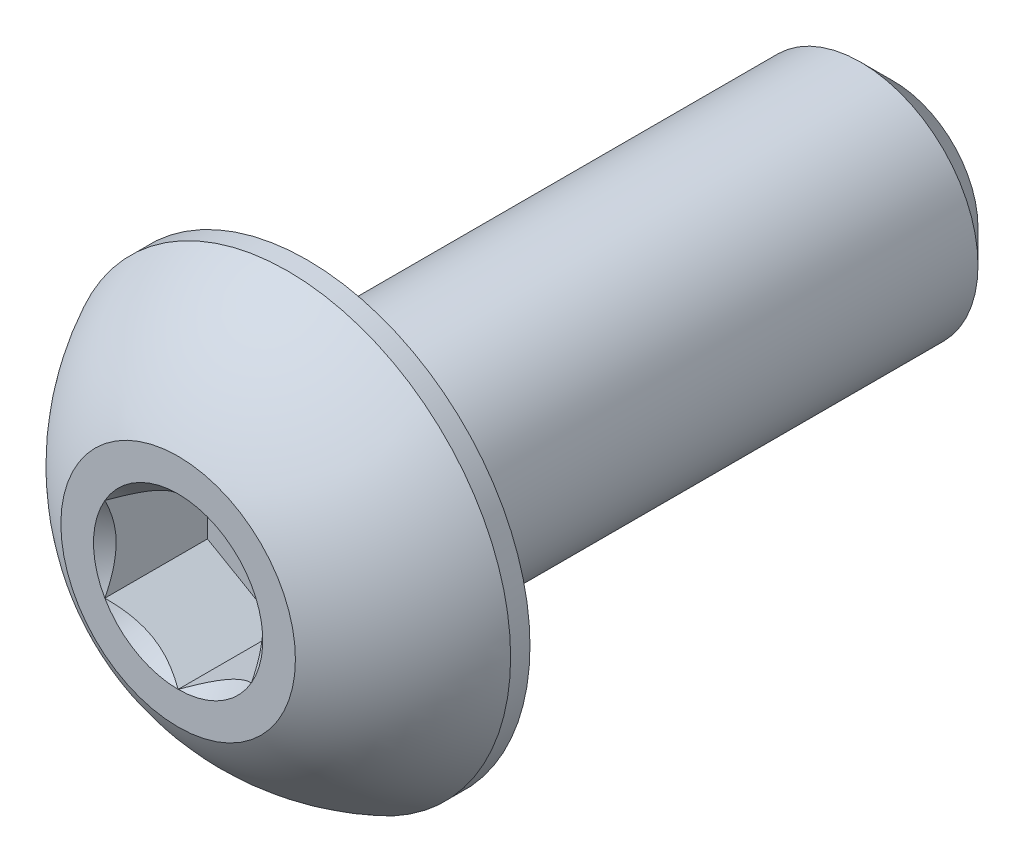
ISO-10303-21;
HEADER;
FILE_DESCRIPTION(('STEP AP214'),'2;1');
FILE_NAME('part.step','',(''),(''),'','','');
FILE_SCHEMA(('AUTOMOTIVE_DESIGN { 1 0 10303 214 1 1 1 1 }'));
ENDSEC;
DATA;
#1=APPLICATION_CONTEXT('core data for automotive mechanical design processes');
#2=APPLICATION_PROTOCOL_DEFINITION('international standard','automotive_design',2000,#1);
#3=PRODUCT_CONTEXT('',#1,'mechanical');
#4=PRODUCT('Part','Part','',(#3));
#5=PRODUCT_RELATED_PRODUCT_CATEGORY('part','',(#4));
#6=PRODUCT_DEFINITION_FORMATION('','',#4);
#7=PRODUCT_DEFINITION_CONTEXT('part definition',#1,'design');
#8=PRODUCT_DEFINITION('design','',#6,#7);
#9=PRODUCT_DEFINITION_SHAPE('','',#8);
#10=(LENGTH_UNIT() NAMED_UNIT(*) SI_UNIT(.MILLI.,.METRE.));
#11=(NAMED_UNIT(*) PLANE_ANGLE_UNIT() SI_UNIT($,.RADIAN.));
#12=(NAMED_UNIT(*) SI_UNIT($,.STERADIAN.) SOLID_ANGLE_UNIT());
#13=UNCERTAINTY_MEASURE_WITH_UNIT(LENGTH_MEASURE(1.E-05),#10,'distance_accuracy_value','');
#14=(GEOMETRIC_REPRESENTATION_CONTEXT(3) GLOBAL_UNCERTAINTY_ASSIGNED_CONTEXT((#13)) GLOBAL_UNIT_ASSIGNED_CONTEXT((#10,
#11,#12)) REPRESENTATION_CONTEXT('',''));
#15=CARTESIAN_POINT('',(0.,0.,0.));
#16=DIRECTION('',(0.,0.,1.));
#17=DIRECTION('',(1.,0.,0.));
#18=AXIS2_PLACEMENT_3D('',#15,#16,#17);
#19=CARTESIAN_POINT('',(0.,0.,6.1));
#20=DIRECTION('',(0.,0.,-1.));
#21=DIRECTION('',(-1.,0.,0.));
#22=AXIS2_PLACEMENT_3D('',#19,#20,#21);
#23=PLANE('',#22);
#24=CARTESIAN_POINT('',(0.,0.,6.1));
#25=DIRECTION('',(0.,0.,1.));
#26=DIRECTION('',(1.,0.,0.));
#27=AXIS2_PLACEMENT_3D('',#24,#25,#26);
#28=CIRCLE('',#27,1.44337567297406);
#29=CARTESIAN_POINT('',(-1.25,0.721687836487033,6.1));
#30=VERTEX_POINT('',#29);
#31=CARTESIAN_POINT('',(-1.25,-0.721687836487033,6.1));
#32=VERTEX_POINT('',#31);
#33=EDGE_CURVE('E132',#30,#32,#28,.T.);
#34=ORIENTED_EDGE('',*,*,#33,.F.);
#35=CARTESIAN_POINT('',(0.,1.44337567297406,6.1));
#36=VERTEX_POINT('',#35);
#37=EDGE_CURVE('E104',#36,#30,#28,.T.);
#38=ORIENTED_EDGE('',*,*,#37,.F.);
#39=CARTESIAN_POINT('',(1.25,0.721687836487032,6.1));
#40=VERTEX_POINT('',#39);
#41=EDGE_CURVE('E95',#40,#36,#28,.T.);
#42=ORIENTED_EDGE('',*,*,#41,.F.);
#43=CARTESIAN_POINT('',(1.25,-0.721687836487032,6.1));
#44=VERTEX_POINT('',#43);
#45=EDGE_CURVE('E56',#44,#40,#28,.T.);
#46=ORIENTED_EDGE('',*,*,#45,.F.);
#47=CARTESIAN_POINT('',(0.,-1.44337567297406,6.1));
#48=VERTEX_POINT('',#47);
#49=EDGE_CURVE('E63',#48,#44,#28,.T.);
#50=ORIENTED_EDGE('',*,*,#49,.F.);
#51=EDGE_CURVE('E133',#32,#48,#28,.T.);
#52=ORIENTED_EDGE('',*,*,#51,.F.);
#53=EDGE_LOOP('',(#34,#38,#42,#46,#50,#52));
#54=FACE_BOUND('',#53,.T.);
#55=CARTESIAN_POINT('',(0.,0.,6.1));
#56=DIRECTION('',(0.,0.,1.));
#57=DIRECTION('',(1.,0.,0.));
#58=AXIS2_PLACEMENT_3D('',#55,#56,#57);
#59=CIRCLE('',#58,2.);
#60=CARTESIAN_POINT('',(0.,2.,6.1));
#61=VERTEX_POINT('',#60);
#62=EDGE_CURVE('E50',#61,#61,#59,.T.);
#63=ORIENTED_EDGE('',*,*,#62,.T.);
#64=EDGE_LOOP('',(#63));
#65=FACE_BOUND('',#64,.T.);
#66=ADVANCED_FACE('F37',(#54,#65),#23,.F.);
#67=CARTESIAN_POINT('',(0.,0.,2.37355614973262));
#68=DIRECTION('',(0.,0.,1.));
#69=DIRECTION('',(0.,1.,0.));
#70=AXIS2_PLACEMENT_3D('',#67,#68,#69);
#71=SPHERICAL_SURFACE('',#70,4.22922968981298);
#72=CARTESIAN_POINT('',(0.,0.,4.23));
#73=DIRECTION('',(0.,0.,1.));
#74=DIRECTION('',(1.,0.,0.));
#75=AXIS2_PLACEMENT_3D('',#72,#73,#74);
#76=CIRCLE('',#75,3.8);
#77=CARTESIAN_POINT('',(0.,3.8,4.23));
#78=VERTEX_POINT('',#77);
#79=EDGE_CURVE('E215',#78,#78,#76,.T.);
#80=CARTESIAN_POINT('',(0.,2.,6.1));
#81=CARTESIAN_POINT('',(0.,2.02421343985614,6.08700457403551));
#82=CARTESIAN_POINT('',(0.,2.04830018323974,6.07377308703487));
#83=CARTESIAN_POINT('',(0.,2.09621120342126,6.04684315849425));
#84=CARTESIAN_POINT('',(0.,2.12003548021917,6.03314471695428));
#85=CARTESIAN_POINT('',(0.,2.16741249358867,6.00528604686797));
#86=CARTESIAN_POINT('',(0.,2.19096523016026,5.99112581832164));
#87=CARTESIAN_POINT('',(0.,2.23779021933682,5.96234896476405));
#88=CARTESIAN_POINT('',(0.,2.2610624719418,5.94773233975278));
#89=CARTESIAN_POINT('',(0.,2.30731764886072,5.91804824448586));
#90=CARTESIAN_POINT('',(0.,2.33030057317465,5.90298077423021));
#91=CARTESIAN_POINT('',(0.,2.37596836104235,5.87240071441713));
#92=CARTESIAN_POINT('',(0.,2.39865322459612,5.85688812485971));
#93=CARTESIAN_POINT('',(0.,2.44371627121513,5.82542372060412));
#94=CARTESIAN_POINT('',(0.,2.46609445428038,5.80947190590595));
#95=CARTESIAN_POINT('',(0.,2.51053563686181,5.77713511266833));
#96=CARTESIAN_POINT('',(0.,2.532598636378,5.76075013412888));
#97=CARTESIAN_POINT('',(0.,2.57640106852492,5.72755323903277));
#98=CARTESIAN_POINT('',(0.,2.59814050115564,5.71074132247611));
#99=CARTESIAN_POINT('',(0.,2.64128753915153,5.67669693941185));
#100=CARTESIAN_POINT('',(0.,2.66269514451671,5.65946447290426));
#101=CARTESIAN_POINT('',(0.,2.70517039368395,5.62458553779704));
#102=CARTESIAN_POINT('',(0.,2.72623803748602,5.6069390691974));
#103=CARTESIAN_POINT('',(0.,2.76802535840618,5.57123883507559));
#104=CARTESIAN_POINT('',(0.,2.78874503552428,5.55318506955341));
#105=CARTESIAN_POINT('',(0.,2.82982855017313,5.51667710151719));
#106=CARTESIAN_POINT('',(0.,2.85019238770389,5.49822289900316));
#107=CARTESIAN_POINT('',(0.,2.89055648548394,5.46092106906898));
#108=CARTESIAN_POINT('',(0.,2.91055674573324,5.44207344164884));
#109=CARTESIAN_POINT('',(0.,2.95018608940553,5.40399192347874));
#110=CARTESIAN_POINT('',(0.,2.96981517282852,5.38475803272878));
#111=CARTESIAN_POINT('',(0.,3.00869470434027,5.34591129624471));
#112=CARTESIAN_POINT('',(0.,3.02794515242903,5.3262984505106));
#113=CARTESIAN_POINT('',(0.,3.06606009863533,5.28670125639628));
#114=CARTESIAN_POINT('',(0.,3.08492459675287,5.26671690801607));
#115=CARTESIAN_POINT('',(0.,3.12226047503002,5.22638430210832));
#116=CARTESIAN_POINT('',(0.,3.14073185518965,5.20603604458079));
#117=CARTESIAN_POINT('',(0.,3.17727447893821,5.16498335215256));
#118=CARTESIAN_POINT('',(0.,3.19534572252715,5.14427891725186));
#119=CARTESIAN_POINT('',(0.,3.23108120656242,5.10252173718901));
#120=CARTESIAN_POINT('',(0.,3.24874544700875,5.08146899202686));
#121=CARTESIAN_POINT('',(0.,3.28366021283673,5.03902319090103));
#122=CARTESIAN_POINT('',(0.,3.30091073821838,5.01763013493736));
#123=CARTESIAN_POINT('',(0.,3.33499151919534,4.97451184097717));
#124=CARTESIAN_POINT('',(0.,3.35182177479064,4.95278660298064));
#125=CARTESIAN_POINT('',(0.,3.38505562116371,4.9090121999432));
#126=CARTESIAN_POINT('',(0.,3.40145921194149,4.88696303490229));
#127=CARTESIAN_POINT('',(0.,3.43383349577047,4.84254915584848));
#128=CARTESIAN_POINT('',(0.,3.44980418882166,4.8201844418356));
#129=CARTESIAN_POINT('',(0.,3.48130660877275,4.77514796280767));
#130=CARTESIAN_POINT('',(0.,3.49683833567264,4.75247619779264));
#131=CARTESIAN_POINT('',(0.,3.52745692170931,4.70683423141033));
#132=CARTESIAN_POINT('',(0.,3.5425437808461,4.68386403004306));
#133=CARTESIAN_POINT('',(0.,3.57226689871518,4.63763391896935));
#134=CARTESIAN_POINT('',(0.,3.58690315744748,4.61437400926291));
#135=CARTESIAN_POINT('',(0.,3.61571951333199,4.56757331973341));
#136=CARTESIAN_POINT('',(0.,3.62989961048422,4.54403253991033));
#137=CARTESIAN_POINT('',(0.,3.65779825442823,4.4966790546141));
#138=CARTESIAN_POINT('',(0.,3.67151680122002,4.47286634914094));
#139=CARTESIAN_POINT('',(0.,3.69848713452321,4.42497806212234));
#140=CARTESIAN_POINT('',(0.,3.71173892103461,4.4009024805769));
#141=CARTESIAN_POINT('',(0.,3.73777068821038,4.35249758420785));
#142=CARTESIAN_POINT('',(0.,3.75055066887474,4.32816826938425));
#143=CARTESIAN_POINT('',(0.,3.77563400658953,4.27926517055481));
#144=CARTESIAN_POINT('',(0.,3.78793736363997,4.25469138654898));
#145=CARTESIAN_POINT('',(0.,3.8,4.23));
#146=B_SPLINE_CURVE_WITH_KNOTS('',3,(#80,#81,#82,#83,#84,#85,#86,#87,#88,#89,#90,#91,#92,#93,
#94,#95,#96,#97,#98,#99,#100,#101,#102,#103,#104,#105,#106,#107,#108,#109,#110,#111,#112,#113,
#114,#115,#116,#117,#118,#119,#120,#121,#122,#123,#124,#125,#126,#127,#128,#129,#130,#131,#132,
#133,#134,#135,#136,#137,#138,#139,#140,#141,#142,#143,#144,#145),.UNSPECIFIED.,.F.,.F.,(4,2,2,
2,2,2,2,2,2,2,2,2,2,2,2,2,2,2,2,2,2,2,2,2,2,2,2,2,2,2,2,2,4),(0.,0.0824398589102646,
0.164879717820529,0.247319576730793,0.329759435641058,0.412199294551322,0.494639153461587,
0.57707901237185,0.659518871282115,0.741958730192379,0.824398589102644,0.906838448012908,
0.989278306923172,1.07171816583344,1.1541580247437,1.23659788365396,1.31903774256423,
1.40147760147449,1.48391746038476,1.56635731929502,1.64879717820529,1.73123703711555,
1.81367689602582,1.89611675493608,1.97855661384634,2.06099647275661,2.14343633166687,
2.22587619057714,2.3083160494874,2.39075590839767,2.47319576730793,2.55563562621819,
2.63807548512846),.UNSPECIFIED.);
#147=EDGE_CURVE('BSEAM220',#61,#78,#146,.T.);
#148=ORIENTED_EDGE('',*,*,#62,.F.);
#149=ORIENTED_EDGE('',*,*,#79,.T.);
#150=ORIENTED_EDGE('',*,*,#147,.T.);
#151=ORIENTED_EDGE('',*,*,#147,.F.);
#152=EDGE_LOOP('',(#148,#150,#149,#151));
#153=FACE_BOUND('',#152,.T.);
#154=ADVANCED_FACE('F220',(#153),#71,.T.);
#155=CARTESIAN_POINT('',(0.,0.,6.1));
#156=DIRECTION('',(0.,0.,1.));
#157=DIRECTION('',(1.,0.,0.));
#158=AXIS2_PLACEMENT_3D('',#155,#156,#157);
#159=CYLINDRICAL_SURFACE('',#158,3.8);
#160=ORIENTED_EDGE('',*,*,#79,.F.);
#161=EDGE_LOOP('',(#160));
#162=FACE_BOUND('',#161,.T.);
#163=CARTESIAN_POINT('',(0.,0.,3.9));
#164=DIRECTION('',(0.,0.,1.));
#165=DIRECTION('',(1.,0.,0.));
#166=AXIS2_PLACEMENT_3D('',#163,#164,#165);
#167=CIRCLE('',#166,3.8);
#168=CARTESIAN_POINT('',(3.8,0.,3.9));
#169=VERTEX_POINT('',#168);
#170=EDGE_CURVE('E212',#169,#169,#167,.T.);
#171=ORIENTED_EDGE('',*,*,#170,.T.);
#172=EDGE_LOOP('',(#171));
#173=FACE_BOUND('',#172,.T.);
#174=ADVANCED_FACE('F223',(#162,#173),#159,.T.);
#175=CARTESIAN_POINT('',(0.,2.,3.9));
#176=DIRECTION('',(0.,0.,1.));
#177=DIRECTION('',(1.,0.,0.));
#178=AXIS2_PLACEMENT_3D('',#175,#176,#177);
#179=PLANE('',#178);
#180=ORIENTED_EDGE('',*,*,#170,.F.);
#181=EDGE_LOOP('',(#180));
#182=FACE_BOUND('',#181,.T.);
#183=CARTESIAN_POINT('',(0.,0.,3.9));
#184=DIRECTION('',(0.,0.,1.));
#185=DIRECTION('',(1.,0.,0.));
#186=AXIS2_PLACEMENT_3D('',#183,#184,#185);
#187=CIRCLE('',#186,2.);
#188=CARTESIAN_POINT('',(2.,0.,3.9));
#189=VERTEX_POINT('',#188);
#190=EDGE_CURVE('E209',#189,#189,#187,.T.);
#191=ORIENTED_EDGE('',*,*,#190,.T.);
#192=EDGE_LOOP('',(#191));
#193=FACE_BOUND('',#192,.T.);
#194=ADVANCED_FACE('F228',(#182,#193),#179,.F.);
#195=CARTESIAN_POINT('',(0.,0.,6.1));
#196=DIRECTION('',(0.,0.,1.));
#197=DIRECTION('',(1.,0.,0.));
#198=AXIS2_PLACEMENT_3D('',#195,#196,#197);
#199=CYLINDRICAL_SURFACE('',#198,2.);
#200=ORIENTED_EDGE('',*,*,#190,.F.);
#201=EDGE_LOOP('',(#200));
#202=FACE_BOUND('',#201,.T.);
#203=CARTESIAN_POINT('',(0.,0.,-5.54));
#204=DIRECTION('',(0.,0.,1.));
#205=DIRECTION('',(1.,0.,0.));
#206=AXIS2_PLACEMENT_3D('',#203,#204,#205);
#207=CIRCLE('',#206,2.);
#208=CARTESIAN_POINT('',(2.,0.,-5.54));
#209=VERTEX_POINT('',#208);
#210=EDGE_CURVE('E206',#209,#209,#207,.T.);
#211=ORIENTED_EDGE('',*,*,#210,.T.);
#212=EDGE_LOOP('',(#211));
#213=FACE_BOUND('',#212,.T.);
#214=ADVANCED_FACE('F234',(#202,#213),#199,.T.);
#215=CARTESIAN_POINT('',(0.,0.,-6.1));
#216=DIRECTION('',(0.,0.,1.));
#217=DIRECTION('',(1.,0.,0.));
#218=AXIS2_PLACEMENT_3D('',#215,#216,#217);
#219=CONICAL_SURFACE('',#218,1.44,0.785398163397445);
#220=ORIENTED_EDGE('',*,*,#210,.F.);
#221=EDGE_LOOP('',(#220));
#222=FACE_BOUND('',#221,.T.);
#223=CARTESIAN_POINT('',(0.,0.,-6.1));
#224=DIRECTION('',(0.,0.,1.));
#225=DIRECTION('',(1.,0.,0.));
#226=AXIS2_PLACEMENT_3D('',#223,#224,#225);
#227=CIRCLE('',#226,1.44);
#228=CARTESIAN_POINT('',(1.44,0.,-6.1));
#229=VERTEX_POINT('',#228);
#230=EDGE_CURVE('E193',#229,#229,#227,.T.);
#231=ORIENTED_EDGE('',*,*,#230,.T.);
#232=EDGE_LOOP('',(#231));
#233=FACE_BOUND('',#232,.T.);
#234=ADVANCED_FACE('F240',(#222,#233),#219,.T.);
#235=CARTESIAN_POINT('',(0.,0.,-6.1));
#236=DIRECTION('',(0.,0.,1.));
#237=DIRECTION('',(1.,0.,0.));
#238=AXIS2_PLACEMENT_3D('',#235,#236,#237);
#239=PLANE('',#238);
#240=ORIENTED_EDGE('',*,*,#230,.F.);
#241=EDGE_LOOP('',(#240));
#242=FACE_BOUND('',#241,.T.);
#243=ADVANCED_FACE('F166',(#242),#239,.F.);
#244=CARTESIAN_POINT('',(0.,0.,6.1));
#245=DIRECTION('',(0.,0.,1.));
#246=DIRECTION('',(1.,0.,0.));
#247=AXIS2_PLACEMENT_3D('',#244,#245,#246);
#248=CONICAL_SURFACE('',#247,1.44337567297406,0.78539816339745);
#249=ORIENTED_EDGE('',*,*,#37,.T.);
#250=CARTESIAN_POINT('',(0.000199999999999987,1.4434911430279,6.10011548390914));
#251=CARTESIAN_POINT('',(-0.0427751670715869,1.41867941875065,6.07532166805511));
#252=CARTESIAN_POINT('',(-0.0864690047459484,1.39345276980743,6.05198373441868));
#253=CARTESIAN_POINT('',(-0.175565930841942,1.34201263554194,6.00925200408454));
#254=CARTESIAN_POINT('',(-0.220977498357064,1.31579425481276,5.98988199236041));
#255=CARTESIAN_POINT('',(-0.31254782093526,1.26292610442246,5.95670048341348));
#256=CARTESIAN_POINT('',(-0.358683240175886,1.23628980770471,5.94280555905266));
#257=CARTESIAN_POINT('',(-0.451970080407593,1.18243062538508,5.92139728216064));
#258=CARTESIAN_POINT('',(-0.49911864913638,1.15520938653761,5.91386794156679));
#259=CARTESIAN_POINT('',(-0.580373556887253,1.10829684367467,5.9070744980507));
#260=CARTESIAN_POINT('',(-0.614374876627941,1.08866617256958,5.90606855910435));
#261=CARTESIAN_POINT('',(-0.682317764432478,1.04943932800611,5.90776141491132));
#262=CARTESIAN_POINT('',(-0.716259317655658,1.02984316311599,5.91046102721554));
#263=CARTESIAN_POINT('',(-0.7838148564575,0.990839954603499,5.91940893031638));
#264=CARTESIAN_POINT('',(-0.817428507286775,0.971433104248771,5.92566052589971));
#265=CARTESIAN_POINT('',(-0.884094638217813,0.932943395609905,5.94137568141391));
#266=CARTESIAN_POINT('',(-0.917146871030296,0.913860680098301,5.95084062008746));
#267=CARTESIAN_POINT('',(-1.00179969160026,0.864986351354568,5.97893139068759));
#268=CARTESIAN_POINT('',(-1.05286649242964,0.835502920149076,5.9996701574522));
#269=CARTESIAN_POINT('',(-1.15300085411325,0.777690319475909,6.04638713467148));
#270=CARTESIAN_POINT('',(-1.20207431157827,0.749357745598417,6.07234829594677));
#271=CARTESIAN_POINT('',(-1.2502,0.721572366433195,6.10011548390914));
#272=B_SPLINE_CURVE_WITH_KNOTS('',3,(#250,#251,#252,#253,#254,#255,#256,#257,#258,#259,#260,
#261,#262,#263,#264,#265,#266,#267,#268,#269,#270,#271),.UNSPECIFIED.,.F.,.F.,(4,2,2,2,2,2,2,2,
2,2,4),(0.,0.166533409618304,0.334037607289762,0.498880396489699,0.663307919240275,
0.780963963458827,0.898645970148453,1.01643764860773,1.1342799317155,1.32148652032141,
1.50809158792573),.UNSPECIFIED.);
#273=EDGE_CURVE('E11',#36,#30,#272,.T.);
#274=ORIENTED_EDGE('',*,*,#273,.F.);
#275=EDGE_LOOP('',(#249,#274));
#276=FACE_BOUND('',#275,.T.);
#277=ADVANCED_FACE('F108',(#276),#248,.F.);
#278=ORIENTED_EDGE('',*,*,#33,.T.);
#279=CARTESIAN_POINT('',(-1.25,-1.43934010808077,6.56298209689233));
#280=CARTESIAN_POINT('',(-1.25,-1.40429313005659,6.53652492263289));
#281=CARTESIAN_POINT('',(-1.25,-1.36905087135599,6.51032716035428));
#282=CARTESIAN_POINT('',(-1.25,-1.29809650706311,6.45855757183958));
#283=CARTESIAN_POINT('',(-1.25,-1.26238428576495,6.43298590435629));
#284=CARTESIAN_POINT('',(-1.25,-1.15390111792708,6.35700599368946));
#285=CARTESIAN_POINT('',(-1.25,-1.08031646726264,6.30774028618957));
#286=CARTESIAN_POINT('',(-1.25,-0.926012322755095,6.21102583026313));
#287=CARTESIAN_POINT('',(-1.25,-0.845125318656146,6.1638412989418));
#288=CARTESIAN_POINT('',(-1.25,-0.679311174076602,6.07753073439041));
#289=CARTESIAN_POINT('',(-1.25,-0.594398891026687,6.0383775346269));
#290=CARTESIAN_POINT('',(-1.25,-0.46694481246074,5.99047722368829));
#291=CARTESIAN_POINT('',(-1.25,-0.426289985812821,5.97672948978634));
#292=CARTESIAN_POINT('',(-1.25,-0.343998850091267,5.95249792745054));
#293=CARTESIAN_POINT('',(-1.25,-0.302362473614962,5.94201432386977));
#294=CARTESIAN_POINT('',(-1.25,-0.219052696285665,5.9250301617483));
#295=CARTESIAN_POINT('',(-1.25,-0.1773934284745,5.91846136047137));
#296=CARTESIAN_POINT('',(-1.25,-0.0936293693401921,5.90943505345776));
#297=CARTESIAN_POINT('',(-1.25,-0.0515246558543961,5.90697684099727));
#298=CARTESIAN_POINT('',(-1.25,0.0311890576306314,5.90635406201329));
#299=CARTESIAN_POINT('',(-1.25,0.0717969625499302,5.90803711684625));
#300=CARTESIAN_POINT('',(-1.25,0.152668636885197,5.91526827059791));
#301=CARTESIAN_POINT('',(-1.25,0.192932338835358,5.92081711041311));
#302=CARTESIAN_POINT('',(-1.25,0.273499879165295,5.93557103646495));
#303=CARTESIAN_POINT('',(-1.25,0.313792180618511,5.94483817596411));
#304=CARTESIAN_POINT('',(-1.25,0.393496413911457,5.96653617845735));
#305=CARTESIAN_POINT('',(-1.25,0.432908419115059,5.97896677673065));
#306=CARTESIAN_POINT('',(-1.25,0.556992735862298,6.02277935293144));
#307=CARTESIAN_POINT('',(-1.25,0.639898924666085,6.05915107287596));
#308=CARTESIAN_POINT('',(-1.25,0.801816555499701,6.14001916217834));
#309=CARTESIAN_POINT('',(-1.25,0.880812666325044,6.18454472091199));
#310=CARTESIAN_POINT('',(-1.25,1.0317856127975,6.27640487666662));
#311=CARTESIAN_POINT('',(-1.25,1.10391618485086,6.32348993391625));
#312=CARTESIAN_POINT('',(-1.25,1.2101860604331,6.39627856159854));
#313=CARTESIAN_POINT('',(-1.25,1.24515069969379,6.42079808539336));
#314=CARTESIAN_POINT('',(-1.25,1.31460220852736,6.47048563676568));
#315=CARTESIAN_POINT('',(-1.25,1.34908920596618,6.49565348541552));
#316=CARTESIAN_POINT('',(-1.25,1.38337731682911,6.52109014884121));
#317=B_SPLINE_CURVE_WITH_KNOTS('',3,(#279,#280,#281,#282,#283,#284,#285,#286,#287,#288,#289,
#290,#291,#292,#293,#294,#295,#296,#297,#298,#299,#300,#301,#302,#303,#304,#305,#306,#307,#308,
#309,#310,#311,#312,#313,#314,#315,#316),.UNSPECIFIED.,.F.,.F.,(4,2,2,2,2,2,2,2,2,2,2,2,2,2,2,2,
2,2,4),(0.,0.131732960381448,0.263498984161645,0.529042014455825,0.809741926134618,
1.08947609717225,1.21811634272576,1.346765447839,1.47310084517844,1.59941451973784,
1.72115042167849,1.84290966131735,1.96679153905341,2.09066305366039,2.36146692896009,
2.63325989198491,2.89154668212279,3.01965734507713,3.14773302245628),.UNSPECIFIED.);
#318=EDGE_CURVE('E103',#30,#32,#317,.F.);
#319=ORIENTED_EDGE('',*,*,#318,.F.);
#320=EDGE_LOOP('',(#278,#319));
#321=FACE_BOUND('',#320,.T.);
#322=ADVANCED_FACE('F253',(#321),#248,.F.);
#323=ORIENTED_EDGE('',*,*,#51,.T.);
#324=CARTESIAN_POINT('',(-1.2502,-0.721572366433194,6.10011548390914));
#325=CARTESIAN_POINT('',(-1.20722483292841,-0.746384090710444,6.0753216680551));
#326=CARTESIAN_POINT('',(-1.16353099525405,-0.771610739653664,6.05198373441868));
#327=CARTESIAN_POINT('',(-1.07443406915806,-0.823050873919154,6.00925200408454));
#328=CARTESIAN_POINT('',(-1.02902250164294,-0.849269254648333,5.98988199236041));
#329=CARTESIAN_POINT('',(-0.937452179064741,-0.902137405038635,5.95670048341348));
#330=CARTESIAN_POINT('',(-0.891316759824115,-0.928773701756387,5.94280555905266));
#331=CARTESIAN_POINT('',(-0.798029919592409,-0.982632884076012,5.92139728216064));
#332=CARTESIAN_POINT('',(-0.750881350863621,-1.00985412292348,5.91386794156679));
#333=CARTESIAN_POINT('',(-0.669626443112749,-1.05676666578643,5.9070744980507));
#334=CARTESIAN_POINT('',(-0.63562512337206,-1.07639733689152,5.90606855910435));
#335=CARTESIAN_POINT('',(-0.567682235567524,-1.11562418145499,5.90776141491132));
#336=CARTESIAN_POINT('',(-0.533740682344344,-1.1352203463451,5.91046102721554));
#337=CARTESIAN_POINT('',(-0.466185143542502,-1.1742235548576,5.91940893031638));
#338=CARTESIAN_POINT('',(-0.432571492713226,-1.19363040521233,5.92566052589971));
#339=CARTESIAN_POINT('',(-0.365905361782188,-1.23212011385119,5.9413756814139));
#340=CARTESIAN_POINT('',(-0.332853128969706,-1.2512028293628,5.95084062008746));
#341=CARTESIAN_POINT('',(-0.248200308399737,-1.30007715810653,5.97893139068759));
#342=CARTESIAN_POINT('',(-0.197133507570363,-1.32956058931202,5.9996701574522));
#343=CARTESIAN_POINT('',(-0.0969991458867461,-1.38737318998519,6.04638713467148));
#344=CARTESIAN_POINT('',(-0.0479256884217312,-1.41570576386268,6.07234829594677));
#345=CARTESIAN_POINT('',(0.000199999999999486,-1.4434911430279,6.10011548390914));
#346=B_SPLINE_CURVE_WITH_KNOTS('',3,(#324,#325,#326,#327,#328,#329,#330,#331,#332,#333,#334,
#335,#336,#337,#338,#339,#340,#341,#342,#343,#344,#345),.UNSPECIFIED.,.F.,.F.,(4,2,2,2,2,2,2,2,
2,2,4),(0.,0.166533409618303,0.334037607289761,0.498880396489697,0.663307919240273,
0.780963963458825,0.898645970148451,1.01643764860773,1.13427993171549,1.32148652032141,
1.50809158792573),.UNSPECIFIED.);
#347=EDGE_CURVE('E142',#32,#48,#346,.T.);
#348=ORIENTED_EDGE('',*,*,#347,.F.);
#349=EDGE_LOOP('',(#323,#348));
#350=FACE_BOUND('',#349,.T.);
#351=ADVANCED_FACE('F270',(#350),#248,.F.);
#352=ORIENTED_EDGE('',*,*,#49,.T.);
#353=CARTESIAN_POINT('',(-0.000200000000000272,-1.4434911430279,6.10011548390914));
#354=CARTESIAN_POINT('',(0.0427751670715864,-1.41867941875065,6.0753216680551));
#355=CARTESIAN_POINT('',(0.0864690047459478,-1.39345276980743,6.05198373441868));
#356=CARTESIAN_POINT('',(0.175565930841942,-1.34201263554194,6.00925200408454));
#357=CARTESIAN_POINT('',(0.220977498357063,-1.31579425481276,5.98988199236041));
#358=CARTESIAN_POINT('',(0.312547820935259,-1.26292610442246,5.95670048341348));
#359=CARTESIAN_POINT('',(0.358683240175885,-1.23628980770471,5.94280555905266));
#360=CARTESIAN_POINT('',(0.451970080407592,-1.18243062538508,5.92139728216064));
#361=CARTESIAN_POINT('',(0.499118649136379,-1.15520938653761,5.91386794156679));
#362=CARTESIAN_POINT('',(0.580373556887252,-1.10829684367467,5.9070744980507));
#363=CARTESIAN_POINT('',(0.61437487662794,-1.08866617256958,5.90606855910435));
#364=CARTESIAN_POINT('',(0.682317764432477,-1.04943932800611,5.90776141491132));
#365=CARTESIAN_POINT('',(0.716259317655657,-1.02984316311599,5.91046102721554));
#366=CARTESIAN_POINT('',(0.783814856457499,-0.990839954603499,5.91940893031638));
#367=CARTESIAN_POINT('',(0.817428507286775,-0.971433104248771,5.92566052589971));
#368=CARTESIAN_POINT('',(0.884094638217813,-0.932943395609905,5.9413756814139));
#369=CARTESIAN_POINT('',(0.917146871030295,-0.9138606800983,5.95084062008746));
#370=CARTESIAN_POINT('',(1.00179969160026,-0.864986351354568,5.97893139068759));
#371=CARTESIAN_POINT('',(1.05286649242964,-0.835502920149076,5.9996701574522));
#372=CARTESIAN_POINT('',(1.15300085411325,-0.777690319475908,6.04638713467148));
#373=CARTESIAN_POINT('',(1.20207431157827,-0.749357745598417,6.07234829594677));
#374=CARTESIAN_POINT('',(1.2502,-0.721572366433194,6.10011548390914));
#375=B_SPLINE_CURVE_WITH_KNOTS('',3,(#353,#354,#355,#356,#357,#358,#359,#360,#361,#362,#363,
#364,#365,#366,#367,#368,#369,#370,#371,#372,#373,#374),.UNSPECIFIED.,.F.,.F.,(4,2,2,2,2,2,2,2,
2,2,4),(0.,0.166533409618304,0.334037607289761,0.498880396489698,0.663307919240274,
0.780963963458826,0.898645970148452,1.01643764860773,1.13427993171549,1.32148652032141,
1.50809158792574),.UNSPECIFIED.);
#376=EDGE_CURVE('E350',#48,#44,#375,.T.);
#377=ORIENTED_EDGE('',*,*,#376,.F.);
#378=EDGE_LOOP('',(#352,#377));
#379=FACE_BOUND('',#378,.T.);
#380=ADVANCED_FACE('F277',(#379),#248,.F.);
#381=ORIENTED_EDGE('',*,*,#45,.T.);
#382=CARTESIAN_POINT('',(1.25,-1.43934010808077,6.56298209689233));
#383=CARTESIAN_POINT('',(1.25,-1.40429313005659,6.53652492263289));
#384=CARTESIAN_POINT('',(1.25,-1.36905087135599,6.51032716035428));
#385=CARTESIAN_POINT('',(1.25,-1.29809650706311,6.45855757183959));
#386=CARTESIAN_POINT('',(1.25,-1.26238428576495,6.43298590435629));
#387=CARTESIAN_POINT('',(1.25,-1.15390111792708,6.35700599368946));
#388=CARTESIAN_POINT('',(1.25,-1.08031646726264,6.30774028618957));
#389=CARTESIAN_POINT('',(1.25,-0.926012322755096,6.21102583026313));
#390=CARTESIAN_POINT('',(1.25,-0.845125318656147,6.1638412989418));
#391=CARTESIAN_POINT('',(1.25,-0.679311174076602,6.07753073439041));
#392=CARTESIAN_POINT('',(1.25,-0.594398891026687,6.0383775346269));
#393=CARTESIAN_POINT('',(1.25,-0.46694481246074,5.99047722368829));
#394=CARTESIAN_POINT('',(1.25,-0.426289985812821,5.97672948978634));
#395=CARTESIAN_POINT('',(1.25,-0.343998850091267,5.95249792745054));
#396=CARTESIAN_POINT('',(1.25,-0.302362473614962,5.94201432386977));
#397=CARTESIAN_POINT('',(1.25,-0.219052696285665,5.9250301617483));
#398=CARTESIAN_POINT('',(1.25,-0.177393428474499,5.91846136047137));
#399=CARTESIAN_POINT('',(1.25,-0.0936293693401918,5.90943505345776));
#400=CARTESIAN_POINT('',(1.25,-0.0515246558543957,5.90697684099727));
#401=CARTESIAN_POINT('',(1.25,0.0311890576306319,5.90635406201329));
#402=CARTESIAN_POINT('',(1.25,0.0717969625499307,5.90803711684625));
#403=CARTESIAN_POINT('',(1.25,0.152668636885197,5.91526827059791));
#404=CARTESIAN_POINT('',(1.25,0.192932338835358,5.92081711041311));
#405=CARTESIAN_POINT('',(1.25,0.273499879165296,5.93557103646495));
#406=CARTESIAN_POINT('',(1.25,0.313792180618511,5.94483817596411));
#407=CARTESIAN_POINT('',(1.25,0.393496413911457,5.96653617845735));
#408=CARTESIAN_POINT('',(1.25,0.432908419115059,5.97896677673065));
#409=CARTESIAN_POINT('',(1.25,0.556992735862299,6.02277935293144));
#410=CARTESIAN_POINT('',(1.25,0.639898924666087,6.05915107287596));
#411=CARTESIAN_POINT('',(1.25,0.801816555499703,6.14001916217834));
#412=CARTESIAN_POINT('',(1.25,0.880812666325046,6.18454472091199));
#413=CARTESIAN_POINT('',(1.25,1.0317856127975,6.27640487666663));
#414=CARTESIAN_POINT('',(1.25,1.10391618485086,6.32348993391625));
#415=CARTESIAN_POINT('',(1.25,1.21018606043311,6.39627856159854));
#416=CARTESIAN_POINT('',(1.25,1.2451506996938,6.42079808539336));
#417=CARTESIAN_POINT('',(1.25,1.31460220852737,6.47048563676568));
#418=CARTESIAN_POINT('',(1.25,1.34908920596618,6.49565348541552));
#419=CARTESIAN_POINT('',(1.25,1.38337731682912,6.52109014884122));
#420=B_SPLINE_CURVE_WITH_KNOTS('',3,(#382,#383,#384,#385,#386,#387,#388,#389,#390,#391,#392,
#393,#394,#395,#396,#397,#398,#399,#400,#401,#402,#403,#404,#405,#406,#407,#408,#409,#410,#411,
#412,#413,#414,#415,#416,#417,#418,#419),.UNSPECIFIED.,.F.,.F.,(4,2,2,2,2,2,2,2,2,2,2,2,2,2,2,2,
2,2,4),(0.,0.131732960381448,0.263498984161644,0.529042014455825,0.809741926134618,
1.08947609717225,1.21811634272577,1.346765447839,1.47310084517844,1.59941451973784,
1.72115042167849,1.84290966131735,1.96679153905342,2.09066305366039,2.36146692896009,
2.63325989198491,2.89154668212279,3.01965734507713,3.14773302245628),.UNSPECIFIED.);
#421=EDGE_CURVE('E120',#44,#40,#420,.T.);
#422=ORIENTED_EDGE('',*,*,#421,.F.);
#423=EDGE_LOOP('',(#381,#422));
#424=FACE_BOUND('',#423,.T.);
#425=ADVANCED_FACE('F284',(#424),#248,.F.);
#426=ORIENTED_EDGE('',*,*,#41,.T.);
#427=CARTESIAN_POINT('',(1.2502,0.721572366433194,6.10011548390914));
#428=CARTESIAN_POINT('',(1.20722483292841,0.746384090710444,6.07532166805511));
#429=CARTESIAN_POINT('',(1.16353099525405,0.771610739653664,6.05198373441868));
#430=CARTESIAN_POINT('',(1.07443406915806,0.823050873919155,6.00925200408454));
#431=CARTESIAN_POINT('',(1.02902250164294,0.849269254648333,5.98988199236041));
#432=CARTESIAN_POINT('',(0.937452179064741,0.902137405038635,5.95670048341348));
#433=CARTESIAN_POINT('',(0.891316759824115,0.928773701756387,5.94280555905266));
#434=CARTESIAN_POINT('',(0.798029919592408,0.982632884076012,5.92139728216064));
#435=CARTESIAN_POINT('',(0.750881350863621,1.00985412292348,5.91386794156679));
#436=CARTESIAN_POINT('',(0.669626443112748,1.05676666578643,5.9070744980507));
#437=CARTESIAN_POINT('',(0.635625123372059,1.07639733689152,5.90606855910435));
#438=CARTESIAN_POINT('',(0.567682235567523,1.11562418145499,5.90776141491132));
#439=CARTESIAN_POINT('',(0.533740682344343,1.1352203463451,5.91046102721554));
#440=CARTESIAN_POINT('',(0.466185143542501,1.1742235548576,5.91940893031638));
#441=CARTESIAN_POINT('',(0.432571492713225,1.19363040521233,5.92566052589971));
#442=CARTESIAN_POINT('',(0.365905361782187,1.23212011385119,5.9413756814139));
#443=CARTESIAN_POINT('',(0.332853128969705,1.2512028293628,5.95084062008746));
#444=CARTESIAN_POINT('',(0.248200308399736,1.30007715810653,5.97893139068759));
#445=CARTESIAN_POINT('',(0.197133507570362,1.32956058931202,5.9996701574522));
#446=CARTESIAN_POINT('',(0.0969991458867455,1.38737318998519,6.04638713467148));
#447=CARTESIAN_POINT('',(0.0479256884217307,1.41570576386268,6.07234829594677));
#448=CARTESIAN_POINT('',(-0.000200000000000086,1.4434911430279,6.10011548390914));
#449=B_SPLINE_CURVE_WITH_KNOTS('',3,(#427,#428,#429,#430,#431,#432,#433,#434,#435,#436,#437,
#438,#439,#440,#441,#442,#443,#444,#445,#446,#447,#448),.UNSPECIFIED.,.F.,.F.,(4,2,2,2,2,2,2,2,
2,2,4),(0.,0.166533409618304,0.334037607289762,0.498880396489698,0.663307919240274,
0.780963963458827,0.898645970148453,1.01643764860773,1.13427993171549,1.32148652032141,
1.50809158792574),.UNSPECIFIED.);
#450=EDGE_CURVE('E99',#40,#36,#449,.T.);
#451=ORIENTED_EDGE('',*,*,#450,.F.);
#452=EDGE_LOOP('',(#426,#451));
#453=FACE_BOUND('',#452,.T.);
#454=ADVANCED_FACE('F97',(#453),#248,.F.);
#455=CARTESIAN_POINT('',(0.,0.,4.35));
#456=DIRECTION('',(0.,0.,1.));
#457=DIRECTION('',(1.,0.,0.));
#458=AXIS2_PLACEMENT_3D('',#455,#456,#457);
#459=PLANE('',#458);
#460=DIRECTION('',(-0.866025403784439,0.5,0.));
#461=VECTOR('',#460,1.);
#462=CARTESIAN_POINT('',(1.25,0.721687836487032,4.35));
#463=LINE('',#462,#461);
#464=CARTESIAN_POINT('',(1.25,0.721687836487032,4.35));
#465=VERTEX_POINT('',#464);
#466=CARTESIAN_POINT('',(0.,1.44337567297406,4.35));
#467=VERTEX_POINT('',#466);
#468=EDGE_CURVE('E119',#465,#467,#463,.T.);
#469=ORIENTED_EDGE('',*,*,#468,.T.);
#470=DIRECTION('',(-0.866025403784439,-0.5,0.));
#471=VECTOR('',#470,1.);
#472=CARTESIAN_POINT('',(0.,1.44337567297406,4.35));
#473=LINE('',#472,#471);
#474=CARTESIAN_POINT('',(-1.25,0.721687836487033,4.35));
#475=VERTEX_POINT('',#474);
#476=EDGE_CURVE('E124',#467,#475,#473,.T.);
#477=ORIENTED_EDGE('',*,*,#476,.T.);
#478=DIRECTION('',(0.,-1.,0.));
#479=VECTOR('',#478,1.);
#480=CARTESIAN_POINT('',(-1.25,0.721687836487033,4.35));
#481=LINE('',#480,#479);
#482=CARTESIAN_POINT('',(-1.25,-0.721687836487032,4.35));
#483=VERTEX_POINT('',#482);
#484=EDGE_CURVE('E181',#475,#483,#481,.T.);
#485=ORIENTED_EDGE('',*,*,#484,.T.);
#486=DIRECTION('',(0.866025403784439,-0.5,0.));
#487=VECTOR('',#486,1.);
#488=CARTESIAN_POINT('',(-1.25,-0.721687836487032,4.35));
#489=LINE('',#488,#487);
#490=CARTESIAN_POINT('',(0.,-1.44337567297406,4.35));
#491=VERTEX_POINT('',#490);
#492=EDGE_CURVE('E184',#483,#491,#489,.T.);
#493=ORIENTED_EDGE('',*,*,#492,.T.);
#494=DIRECTION('',(0.866025403784439,0.5,0.));
#495=VECTOR('',#494,1.);
#496=CARTESIAN_POINT('',(0.,-1.44337567297406,4.35));
#497=LINE('',#496,#495);
#498=CARTESIAN_POINT('',(1.25,-0.721687836487032,4.35));
#499=VERTEX_POINT('',#498);
#500=EDGE_CURVE('E187',#491,#499,#497,.T.);
#501=ORIENTED_EDGE('',*,*,#500,.T.);
#502=DIRECTION('',(0.,1.,0.));
#503=VECTOR('',#502,1.);
#504=CARTESIAN_POINT('',(1.25,-0.721687836487032,4.35));
#505=LINE('',#504,#503);
#506=EDGE_CURVE('E127',#499,#465,#505,.T.);
#507=ORIENTED_EDGE('',*,*,#506,.T.);
#508=EDGE_LOOP('',(#469,#477,#485,#493,#501,#507));
#509=FACE_BOUND('',#508,.T.);
#510=ADVANCED_FACE('F161',(#509),#459,.T.);
#511=CARTESIAN_POINT('',(0.,1.44337567297406,4.35));
#512=DIRECTION('',(-0.5,0.866025403784439,0.));
#513=DIRECTION('',(-0.866025403784439,-0.5,0.));
#514=AXIS2_PLACEMENT_3D('',#511,#512,#513);
#515=PLANE('',#514);
#516=DIRECTION('',(0.,0.,1.));
#517=VECTOR('',#516,1.);
#518=CARTESIAN_POINT('',(0.,1.44337567297406,4.35));
#519=LINE('',#518,#517);
#520=EDGE_CURVE('E116',#467,#36,#519,.T.);
#521=ORIENTED_EDGE('',*,*,#520,.T.);
#522=ORIENTED_EDGE('',*,*,#273,.T.);
#523=DIRECTION('',(0.,0.,1.));
#524=VECTOR('',#523,1.);
#525=CARTESIAN_POINT('',(-1.25,0.721687836487033,4.35));
#526=LINE('',#525,#524);
#527=EDGE_CURVE('E126',#475,#30,#526,.T.);
#528=ORIENTED_EDGE('',*,*,#527,.F.);
#529=ORIENTED_EDGE('',*,*,#476,.F.);
#530=EDGE_LOOP('',(#521,#522,#528,#529));
#531=FACE_BOUND('',#530,.T.);
#532=ADVANCED_FACE('F122',(#531),#515,.F.);
#533=CARTESIAN_POINT('',(-1.25,0.721687836487033,4.35));
#534=DIRECTION('',(-1.,0.,0.));
#535=DIRECTION('',(0.,0.,1.));
#536=AXIS2_PLACEMENT_3D('',#533,#534,#535);
#537=PLANE('',#536);
#538=ORIENTED_EDGE('',*,*,#527,.T.);
#539=ORIENTED_EDGE('',*,*,#318,.T.);
#540=DIRECTION('',(0.,0.,1.));
#541=VECTOR('',#540,1.);
#542=CARTESIAN_POINT('',(-1.25,-0.721687836487032,4.35));
#543=LINE('',#542,#541);
#544=EDGE_CURVE('E200',#483,#32,#543,.T.);
#545=ORIENTED_EDGE('',*,*,#544,.F.);
#546=ORIENTED_EDGE('',*,*,#484,.F.);
#547=EDGE_LOOP('',(#538,#539,#545,#546));
#548=FACE_BOUND('',#547,.T.);
#549=ADVANCED_FACE('F151',(#548),#537,.F.);
#550=CARTESIAN_POINT('',(-1.25,-0.721687836487032,4.35));
#551=DIRECTION('',(-0.5,-0.866025403784438,0.));
#552=DIRECTION('',(0.866025403784439,-0.5,0.));
#553=AXIS2_PLACEMENT_3D('',#550,#551,#552);
#554=PLANE('',#553);
#555=ORIENTED_EDGE('',*,*,#544,.T.);
#556=ORIENTED_EDGE('',*,*,#347,.T.);
#557=DIRECTION('',(0.,0.,1.));
#558=VECTOR('',#557,1.);
#559=CARTESIAN_POINT('',(0.,-1.44337567297406,4.35));
#560=LINE('',#559,#558);
#561=EDGE_CURVE('E197',#491,#48,#560,.T.);
#562=ORIENTED_EDGE('',*,*,#561,.F.);
#563=ORIENTED_EDGE('',*,*,#492,.F.);
#564=EDGE_LOOP('',(#555,#556,#562,#563));
#565=FACE_BOUND('',#564,.T.);
#566=ADVANCED_FACE('F154',(#565),#554,.F.);
#567=CARTESIAN_POINT('',(0.,-1.44337567297406,4.35));
#568=DIRECTION('',(0.5,-0.866025403784439,0.));
#569=DIRECTION('',(0.866025403784439,0.5,0.));
#570=AXIS2_PLACEMENT_3D('',#567,#568,#569);
#571=PLANE('',#570);
#572=ORIENTED_EDGE('',*,*,#561,.T.);
#573=ORIENTED_EDGE('',*,*,#376,.T.);
#574=DIRECTION('',(0.,0.,1.));
#575=VECTOR('',#574,1.);
#576=CARTESIAN_POINT('',(1.25,-0.721687836487032,4.35));
#577=LINE('',#576,#575);
#578=EDGE_CURVE('E194',#499,#44,#577,.T.);
#579=ORIENTED_EDGE('',*,*,#578,.F.);
#580=ORIENTED_EDGE('',*,*,#500,.F.);
#581=EDGE_LOOP('',(#572,#573,#579,#580));
#582=FACE_BOUND('',#581,.T.);
#583=ADVANCED_FACE('F308',(#582),#571,.F.);
#584=CARTESIAN_POINT('',(1.25,-0.721687836487032,4.35));
#585=DIRECTION('',(1.,0.,0.));
#586=DIRECTION('',(0.,1.,0.));
#587=AXIS2_PLACEMENT_3D('',#584,#585,#586);
#588=PLANE('',#587);
#589=ORIENTED_EDGE('',*,*,#578,.T.);
#590=ORIENTED_EDGE('',*,*,#421,.T.);
#591=DIRECTION('',(0.,0.,1.));
#592=VECTOR('',#591,1.);
#593=CARTESIAN_POINT('',(1.25,0.721687836487032,4.35));
#594=LINE('',#593,#592);
#595=EDGE_CURVE('E118',#465,#40,#594,.T.);
#596=ORIENTED_EDGE('',*,*,#595,.F.);
#597=ORIENTED_EDGE('',*,*,#506,.F.);
#598=EDGE_LOOP('',(#589,#590,#596,#597));
#599=FACE_BOUND('',#598,.T.);
#600=ADVANCED_FACE('F165',(#599),#588,.F.);
#601=CARTESIAN_POINT('',(1.25,0.721687836487032,4.35));
#602=DIRECTION('',(0.5,0.866025403784438,0.));
#603=DIRECTION('',(-0.866025403784439,0.5,0.));
#604=AXIS2_PLACEMENT_3D('',#601,#602,#603);
#605=PLANE('',#604);
#606=ORIENTED_EDGE('',*,*,#595,.T.);
#607=ORIENTED_EDGE('',*,*,#450,.T.);
#608=ORIENTED_EDGE('',*,*,#520,.F.);
#609=ORIENTED_EDGE('',*,*,#468,.F.);
#610=EDGE_LOOP('',(#606,#607,#608,#609));
#611=FACE_BOUND('',#610,.T.);
#612=ADVANCED_FACE('F114',(#611),#605,.F.);
#613=CLOSED_SHELL('',(#66,#154,#174,#194,#214,#234,#243,#277,#322,#351,#380,#425,#454,#510,#532,
#549,#566,#583,#600,#612));
#614=MANIFOLD_SOLID_BREP('B2',#613);
#615=ADVANCED_BREP_SHAPE_REPRESENTATION('',(#18,#614),#14);
#616=SHAPE_DEFINITION_REPRESENTATION(#9,#615);
ENDSEC;
END-ISO-10303-21;
